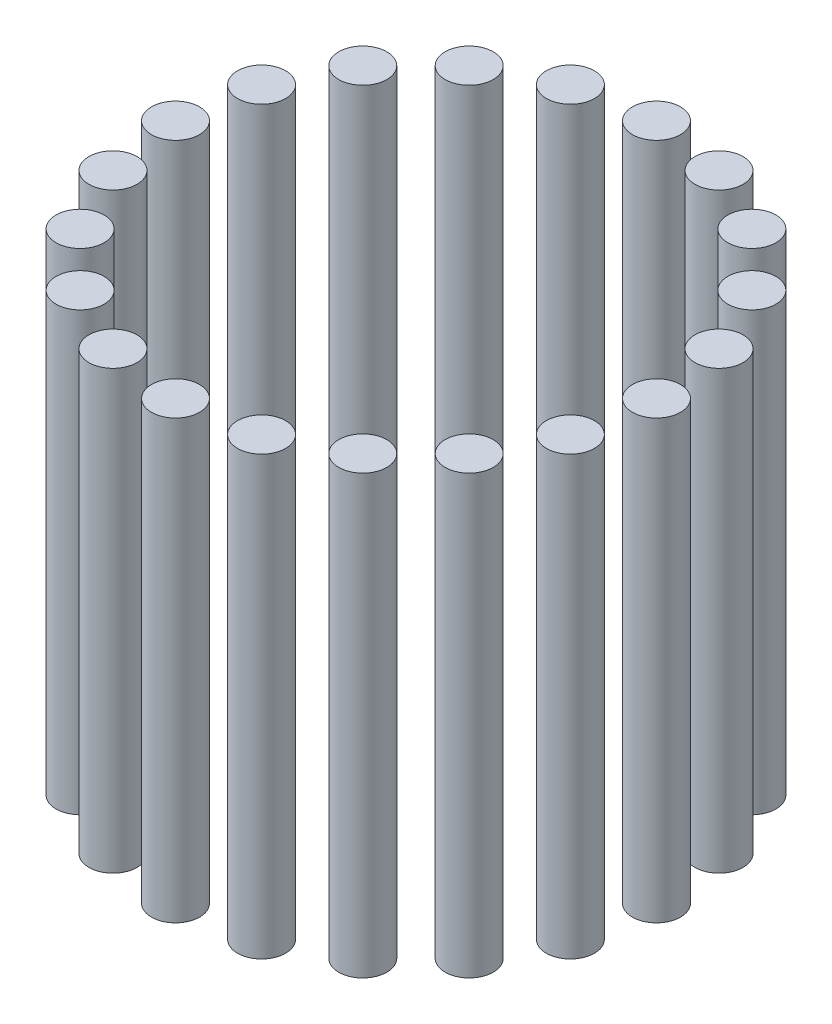
ISO-10303-21;
HEADER;
FILE_DESCRIPTION(('STEP AP214'),'2;1');
FILE_NAME('part.step','',(''),(''),'','','');
FILE_SCHEMA(('AUTOMOTIVE_DESIGN { 1 0 10303 214 1 1 1 1 }'));
ENDSEC;
DATA;
#1=APPLICATION_CONTEXT('core data for automotive mechanical design processes');
#2=APPLICATION_PROTOCOL_DEFINITION('international standard','automotive_design',2000,#1);
#3=PRODUCT_CONTEXT('',#1,'mechanical');
#4=PRODUCT('Part','Part','',(#3));
#5=PRODUCT_RELATED_PRODUCT_CATEGORY('part','',(#4));
#6=PRODUCT_DEFINITION_FORMATION('','',#4);
#7=PRODUCT_DEFINITION_CONTEXT('part definition',#1,'design');
#8=PRODUCT_DEFINITION('design','',#6,#7);
#9=PRODUCT_DEFINITION_SHAPE('','',#8);
#10=(LENGTH_UNIT() NAMED_UNIT(*) SI_UNIT(.MILLI.,.METRE.));
#11=(NAMED_UNIT(*) PLANE_ANGLE_UNIT() SI_UNIT($,.RADIAN.));
#12=(NAMED_UNIT(*) SI_UNIT($,.STERADIAN.) SOLID_ANGLE_UNIT());
#13=UNCERTAINTY_MEASURE_WITH_UNIT(LENGTH_MEASURE(1.E-05),#10,'distance_accuracy_value','');
#14=(GEOMETRIC_REPRESENTATION_CONTEXT(3) GLOBAL_UNCERTAINTY_ASSIGNED_CONTEXT((#13)) GLOBAL_UNIT_ASSIGNED_CONTEXT((#10,
#11,#12)) REPRESENTATION_CONTEXT('',''));
#15=CARTESIAN_POINT('',(0.,0.,0.));
#16=DIRECTION('',(0.,0.,1.));
#17=DIRECTION('',(1.,0.,0.));
#18=AXIS2_PLACEMENT_3D('',#15,#16,#17);
#19=CARTESIAN_POINT('',(52.3081083962337,100.,-16.9959346906214));
#20=DIRECTION('',(0.,-1.,0.));
#21=DIRECTION('',(0.,0.,-1.));
#22=AXIS2_PLACEMENT_3D('',#19,#20,#21);
#23=CYLINDRICAL_SURFACE('',#22,5.5);
#24=CARTESIAN_POINT('',(52.3081083962337,100.,-16.9959346906214));
#25=DIRECTION('',(0.,1.,0.));
#26=DIRECTION('',(0.,0.,1.));
#27=AXIS2_PLACEMENT_3D('',#24,#25,#26);
#28=CIRCLE('',#27,5.5);
#29=CARTESIAN_POINT('',(52.3081083962337,100.,-11.4959346906214));
#30=VERTEX_POINT('',#29);
#31=EDGE_CURVE('E48',#30,#30,#28,.T.);
#32=ORIENTED_EDGE('',*,*,#31,.F.);
#33=EDGE_LOOP('',(#32));
#34=FACE_BOUND('',#33,.T.);
#35=CARTESIAN_POINT('',(52.3081083962337,0.,-16.9959346906214));
#36=DIRECTION('',(0.,1.,0.));
#37=DIRECTION('',(0.,0.,1.));
#38=AXIS2_PLACEMENT_3D('',#35,#36,#37);
#39=CIRCLE('',#38,5.5);
#40=CARTESIAN_POINT('',(52.3081083962337,0.,-11.4959346906214));
#41=VERTEX_POINT('',#40);
#42=EDGE_CURVE('E11',#41,#41,#39,.T.);
#43=ORIENTED_EDGE('',*,*,#42,.T.);
#44=EDGE_LOOP('',(#43));
#45=FACE_BOUND('',#44,.T.);
#46=ADVANCED_FACE('F44',(#34,#45),#23,.T.);
#47=CARTESIAN_POINT('',(52.3081083962337,100.,-16.9959346906214));
#48=DIRECTION('',(0.,1.,0.));
#49=DIRECTION('',(0.,0.,1.));
#50=AXIS2_PLACEMENT_3D('',#47,#48,#49);
#51=PLANE('',#50);
#52=ORIENTED_EDGE('',*,*,#31,.T.);
#53=EDGE_LOOP('',(#52));
#54=FACE_BOUND('',#53,.T.);
#55=ADVANCED_FACE('F46',(#54),#51,.T.);
#56=CARTESIAN_POINT('',(52.3081083962337,0.,-16.9959346906214));
#57=DIRECTION('',(0.,1.,0.));
#58=DIRECTION('',(0.,0.,1.));
#59=AXIS2_PLACEMENT_3D('',#56,#57,#58);
#60=PLANE('',#59);
#61=ORIENTED_EDGE('',*,*,#42,.F.);
#62=EDGE_LOOP('',(#61));
#63=FACE_BOUND('',#62,.T.);
#64=ADVANCED_FACE('F63',(#63),#60,.F.);
#65=CLOSED_SHELL('',(#46,#55,#64));
#66=MANIFOLD_SOLID_BREP('B2',#65);
#67=CARTESIAN_POINT('',(44.4959346906225,100.,-32.3281888760854));
#68=DIRECTION('',(0.,-1.,0.));
#69=DIRECTION('',(0.,0.,-1.));
#70=AXIS2_PLACEMENT_3D('',#67,#68,#69);
#71=CYLINDRICAL_SURFACE('',#70,5.5);
#72=CARTESIAN_POINT('',(44.4959346906225,100.,-32.3281888760854));
#73=DIRECTION('',(0.,1.,0.));
#74=DIRECTION('',(0.,0.,1.));
#75=AXIS2_PLACEMENT_3D('',#72,#73,#74);
#76=CIRCLE('',#75,5.5);
#77=CARTESIAN_POINT('',(44.4959346906225,100.,-26.8281888760854));
#78=VERTEX_POINT('',#77);
#79=EDGE_CURVE('E103',#78,#78,#76,.T.);
#80=ORIENTED_EDGE('',*,*,#79,.F.);
#81=EDGE_LOOP('',(#80));
#82=FACE_BOUND('',#81,.T.);
#83=CARTESIAN_POINT('',(44.4959346906225,0.,-32.3281888760854));
#84=DIRECTION('',(0.,1.,0.));
#85=DIRECTION('',(0.,0.,1.));
#86=AXIS2_PLACEMENT_3D('',#83,#84,#85);
#87=CIRCLE('',#86,5.5);
#88=CARTESIAN_POINT('',(44.4959346906225,0.,-26.8281888760854));
#89=VERTEX_POINT('',#88);
#90=EDGE_CURVE('E43',#89,#89,#87,.T.);
#91=ORIENTED_EDGE('',*,*,#90,.T.);
#92=EDGE_LOOP('',(#91));
#93=FACE_BOUND('',#92,.T.);
#94=ADVANCED_FACE('F99',(#82,#93),#71,.T.);
#95=CARTESIAN_POINT('',(44.4959346906225,100.,-32.3281888760854));
#96=DIRECTION('',(0.,1.,0.));
#97=DIRECTION('',(0.,0.,1.));
#98=AXIS2_PLACEMENT_3D('',#95,#96,#97);
#99=PLANE('',#98);
#100=ORIENTED_EDGE('',*,*,#79,.T.);
#101=EDGE_LOOP('',(#100));
#102=FACE_BOUND('',#101,.T.);
#103=ADVANCED_FACE('F101',(#102),#99,.T.);
#104=CARTESIAN_POINT('',(44.4959346906225,0.,-32.3281888760854));
#105=DIRECTION('',(0.,1.,0.));
#106=DIRECTION('',(0.,0.,1.));
#107=AXIS2_PLACEMENT_3D('',#104,#105,#106);
#108=PLANE('',#107);
#109=ORIENTED_EDGE('',*,*,#90,.F.);
#110=EDGE_LOOP('',(#109));
#111=FACE_BOUND('',#110,.T.);
#112=ADVANCED_FACE('F118',(#111),#108,.F.);
#113=CLOSED_SHELL('',(#94,#103,#112));
#114=MANIFOLD_SOLID_BREP('B6',#113);
#115=CARTESIAN_POINT('',(32.3281888760866,100.,-44.4959346906217));
#116=DIRECTION('',(0.,-1.,0.));
#117=DIRECTION('',(0.,0.,-1.));
#118=AXIS2_PLACEMENT_3D('',#115,#116,#117);
#119=CYLINDRICAL_SURFACE('',#118,5.5);
#120=CARTESIAN_POINT('',(32.3281888760866,100.,-44.4959346906217));
#121=DIRECTION('',(0.,1.,0.));
#122=DIRECTION('',(0.,0.,1.));
#123=AXIS2_PLACEMENT_3D('',#120,#121,#122);
#124=CIRCLE('',#123,5.5);
#125=CARTESIAN_POINT('',(32.3281888760866,100.,-38.9959346906217));
#126=VERTEX_POINT('',#125);
#127=EDGE_CURVE('E158',#126,#126,#124,.T.);
#128=ORIENTED_EDGE('',*,*,#127,.F.);
#129=EDGE_LOOP('',(#128));
#130=FACE_BOUND('',#129,.T.);
#131=CARTESIAN_POINT('',(32.3281888760866,0.,-44.4959346906217));
#132=DIRECTION('',(0.,1.,0.));
#133=DIRECTION('',(0.,0.,1.));
#134=AXIS2_PLACEMENT_3D('',#131,#132,#133);
#135=CIRCLE('',#134,5.5);
#136=CARTESIAN_POINT('',(32.3281888760866,0.,-38.9959346906217));
#137=VERTEX_POINT('',#136);
#138=EDGE_CURVE('E98',#137,#137,#135,.T.);
#139=ORIENTED_EDGE('',*,*,#138,.T.);
#140=EDGE_LOOP('',(#139));
#141=FACE_BOUND('',#140,.T.);
#142=ADVANCED_FACE('F154',(#130,#141),#119,.T.);
#143=CARTESIAN_POINT('',(32.3281888760866,100.,-44.4959346906217));
#144=DIRECTION('',(0.,1.,0.));
#145=DIRECTION('',(0.,0.,1.));
#146=AXIS2_PLACEMENT_3D('',#143,#144,#145);
#147=PLANE('',#146);
#148=ORIENTED_EDGE('',*,*,#127,.T.);
#149=EDGE_LOOP('',(#148));
#150=FACE_BOUND('',#149,.T.);
#151=ADVANCED_FACE('F156',(#150),#147,.T.);
#152=CARTESIAN_POINT('',(32.3281888760866,0.,-44.4959346906217));
#153=DIRECTION('',(0.,1.,0.));
#154=DIRECTION('',(0.,0.,1.));
#155=AXIS2_PLACEMENT_3D('',#152,#153,#154);
#156=PLANE('',#155);
#157=ORIENTED_EDGE('',*,*,#138,.F.);
#158=EDGE_LOOP('',(#157));
#159=FACE_BOUND('',#158,.T.);
#160=ADVANCED_FACE('F173',(#159),#156,.F.);
#161=CLOSED_SHELL('',(#142,#151,#160));
#162=MANIFOLD_SOLID_BREP('B38',#161);
#163=CARTESIAN_POINT('',(16.9959346906227,100.,-52.3081083962333));
#164=DIRECTION('',(0.,-1.,0.));
#165=DIRECTION('',(0.,0.,-1.));
#166=AXIS2_PLACEMENT_3D('',#163,#164,#165);
#167=CYLINDRICAL_SURFACE('',#166,5.5);
#168=CARTESIAN_POINT('',(16.9959346906227,100.,-52.3081083962333));
#169=DIRECTION('',(0.,1.,0.));
#170=DIRECTION('',(0.,0.,1.));
#171=AXIS2_PLACEMENT_3D('',#168,#169,#170);
#172=CIRCLE('',#171,5.5);
#173=CARTESIAN_POINT('',(16.9959346906227,100.,-46.8081083962333));
#174=VERTEX_POINT('',#173);
#175=EDGE_CURVE('E213',#174,#174,#172,.T.);
#176=ORIENTED_EDGE('',*,*,#175,.F.);
#177=EDGE_LOOP('',(#176));
#178=FACE_BOUND('',#177,.T.);
#179=CARTESIAN_POINT('',(16.9959346906227,0.,-52.3081083962333));
#180=DIRECTION('',(0.,1.,0.));
#181=DIRECTION('',(0.,0.,1.));
#182=AXIS2_PLACEMENT_3D('',#179,#180,#181);
#183=CIRCLE('',#182,5.5);
#184=CARTESIAN_POINT('',(16.9959346906227,0.,-46.8081083962333));
#185=VERTEX_POINT('',#184);
#186=EDGE_CURVE('E153',#185,#185,#183,.T.);
#187=ORIENTED_EDGE('',*,*,#186,.T.);
#188=EDGE_LOOP('',(#187));
#189=FACE_BOUND('',#188,.T.);
#190=ADVANCED_FACE('F209',(#178,#189),#167,.T.);
#191=CARTESIAN_POINT('',(16.9959346906227,100.,-52.3081083962333));
#192=DIRECTION('',(0.,1.,0.));
#193=DIRECTION('',(0.,0.,1.));
#194=AXIS2_PLACEMENT_3D('',#191,#192,#193);
#195=PLANE('',#194);
#196=ORIENTED_EDGE('',*,*,#175,.T.);
#197=EDGE_LOOP('',(#196));
#198=FACE_BOUND('',#197,.T.);
#199=ADVANCED_FACE('F211',(#198),#195,.T.);
#200=CARTESIAN_POINT('',(16.9959346906227,0.,-52.3081083962333));
#201=DIRECTION('',(0.,1.,0.));
#202=DIRECTION('',(0.,0.,1.));
#203=AXIS2_PLACEMENT_3D('',#200,#201,#202);
#204=PLANE('',#203);
#205=ORIENTED_EDGE('',*,*,#186,.F.);
#206=EDGE_LOOP('',(#205));
#207=FACE_BOUND('',#206,.T.);
#208=ADVANCED_FACE('F228',(#207),#204,.F.);
#209=CLOSED_SHELL('',(#190,#199,#208));
#210=MANIFOLD_SOLID_BREP('B93',#209);
#211=CARTESIAN_POINT('',(5.76094420909117E-13,100.,-55.));
#212=DIRECTION('',(0.,-1.,0.));
#213=DIRECTION('',(0.,0.,-1.));
#214=AXIS2_PLACEMENT_3D('',#211,#212,#213);
#215=CYLINDRICAL_SURFACE('',#214,5.49999999999999);
#216=CARTESIAN_POINT('',(5.76094420909117E-13,100.,-55.));
#217=DIRECTION('',(0.,1.,0.));
#218=DIRECTION('',(0.,0.,1.));
#219=AXIS2_PLACEMENT_3D('',#216,#217,#218);
#220=CIRCLE('',#219,5.49999999999999);
#221=CARTESIAN_POINT('',(5.76094420909117E-13,100.,-49.5));
#222=VERTEX_POINT('',#221);
#223=EDGE_CURVE('E268',#222,#222,#220,.T.);
#224=ORIENTED_EDGE('',*,*,#223,.F.);
#225=EDGE_LOOP('',(#224));
#226=FACE_BOUND('',#225,.T.);
#227=CARTESIAN_POINT('',(5.76094420909117E-13,0.,-55.));
#228=DIRECTION('',(0.,1.,0.));
#229=DIRECTION('',(0.,0.,1.));
#230=AXIS2_PLACEMENT_3D('',#227,#228,#229);
#231=CIRCLE('',#230,5.49999999999999);
#232=CARTESIAN_POINT('',(5.76094420909117E-13,0.,-49.5));
#233=VERTEX_POINT('',#232);
#234=EDGE_CURVE('E208',#233,#233,#231,.T.);
#235=ORIENTED_EDGE('',*,*,#234,.T.);
#236=EDGE_LOOP('',(#235));
#237=FACE_BOUND('',#236,.T.);
#238=ADVANCED_FACE('F264',(#226,#237),#215,.T.);
#239=CARTESIAN_POINT('',(5.76094420909117E-13,100.,-55.));
#240=DIRECTION('',(0.,1.,0.));
#241=DIRECTION('',(0.,0.,1.));
#242=AXIS2_PLACEMENT_3D('',#239,#240,#241);
#243=PLANE('',#242);
#244=ORIENTED_EDGE('',*,*,#223,.T.);
#245=EDGE_LOOP('',(#244));
#246=FACE_BOUND('',#245,.T.);
#247=ADVANCED_FACE('F266',(#246),#243,.T.);
#248=CARTESIAN_POINT('',(5.76094420909117E-13,0.,-55.));
#249=DIRECTION('',(0.,1.,0.));
#250=DIRECTION('',(0.,0.,1.));
#251=AXIS2_PLACEMENT_3D('',#248,#249,#250);
#252=PLANE('',#251);
#253=ORIENTED_EDGE('',*,*,#234,.F.);
#254=EDGE_LOOP('',(#253));
#255=FACE_BOUND('',#254,.T.);
#256=ADVANCED_FACE('F283',(#255),#252,.F.);
#257=CLOSED_SHELL('',(#238,#247,#256));
#258=MANIFOLD_SOLID_BREP('B148',#257);
#259=CARTESIAN_POINT('',(-16.9959346906216,100.,-52.3081083962336));
#260=DIRECTION('',(0.,-1.,0.));
#261=DIRECTION('',(0.,0.,-1.));
#262=AXIS2_PLACEMENT_3D('',#259,#260,#261);
#263=CYLINDRICAL_SURFACE('',#262,5.5);
#264=CARTESIAN_POINT('',(-16.9959346906216,100.,-52.3081083962336));
#265=DIRECTION('',(0.,1.,0.));
#266=DIRECTION('',(0.,0.,1.));
#267=AXIS2_PLACEMENT_3D('',#264,#265,#266);
#268=CIRCLE('',#267,5.5);
#269=CARTESIAN_POINT('',(-16.9959346906216,100.,-46.8081083962336));
#270=VERTEX_POINT('',#269);
#271=EDGE_CURVE('E323',#270,#270,#268,.T.);
#272=ORIENTED_EDGE('',*,*,#271,.F.);
#273=EDGE_LOOP('',(#272));
#274=FACE_BOUND('',#273,.T.);
#275=CARTESIAN_POINT('',(-16.9959346906216,0.,-52.3081083962336));
#276=DIRECTION('',(0.,1.,0.));
#277=DIRECTION('',(0.,0.,1.));
#278=AXIS2_PLACEMENT_3D('',#275,#276,#277);
#279=CIRCLE('',#278,5.5);
#280=CARTESIAN_POINT('',(-16.9959346906216,0.,-46.8081083962336));
#281=VERTEX_POINT('',#280);
#282=EDGE_CURVE('E263',#281,#281,#279,.T.);
#283=ORIENTED_EDGE('',*,*,#282,.T.);
#284=EDGE_LOOP('',(#283));
#285=FACE_BOUND('',#284,.T.);
#286=ADVANCED_FACE('F319',(#274,#285),#263,.T.);
#287=CARTESIAN_POINT('',(-16.9959346906216,100.,-52.3081083962336));
#288=DIRECTION('',(0.,1.,0.));
#289=DIRECTION('',(0.,0.,1.));
#290=AXIS2_PLACEMENT_3D('',#287,#288,#289);
#291=PLANE('',#290);
#292=ORIENTED_EDGE('',*,*,#271,.T.);
#293=EDGE_LOOP('',(#292));
#294=FACE_BOUND('',#293,.T.);
#295=ADVANCED_FACE('F321',(#294),#291,.T.);
#296=CARTESIAN_POINT('',(-16.9959346906216,0.,-52.3081083962336));
#297=DIRECTION('',(0.,1.,0.));
#298=DIRECTION('',(0.,0.,1.));
#299=AXIS2_PLACEMENT_3D('',#296,#297,#298);
#300=PLANE('',#299);
#301=ORIENTED_EDGE('',*,*,#282,.F.);
#302=EDGE_LOOP('',(#301));
#303=FACE_BOUND('',#302,.T.);
#304=ADVANCED_FACE('F338',(#303),#300,.F.);
#305=CLOSED_SHELL('',(#286,#295,#304));
#306=MANIFOLD_SOLID_BREP('B203',#305);
#307=CARTESIAN_POINT('',(-32.3281888760856,100.,-44.4959346906224));
#308=DIRECTION('',(0.,-1.,0.));
#309=DIRECTION('',(0.,0.,-1.));
#310=AXIS2_PLACEMENT_3D('',#307,#308,#309);
#311=CYLINDRICAL_SURFACE('',#310,5.49999999999999);
#312=CARTESIAN_POINT('',(-32.3281888760856,100.,-44.4959346906224));
#313=DIRECTION('',(0.,1.,0.));
#314=DIRECTION('',(0.,0.,1.));
#315=AXIS2_PLACEMENT_3D('',#312,#313,#314);
#316=CIRCLE('',#315,5.49999999999999);
#317=CARTESIAN_POINT('',(-32.3281888760856,100.,-38.9959346906224));
#318=VERTEX_POINT('',#317);
#319=EDGE_CURVE('E378',#318,#318,#316,.T.);
#320=ORIENTED_EDGE('',*,*,#319,.F.);
#321=EDGE_LOOP('',(#320));
#322=FACE_BOUND('',#321,.T.);
#323=CARTESIAN_POINT('',(-32.3281888760856,0.,-44.4959346906224));
#324=DIRECTION('',(0.,1.,0.));
#325=DIRECTION('',(0.,0.,1.));
#326=AXIS2_PLACEMENT_3D('',#323,#324,#325);
#327=CIRCLE('',#326,5.49999999999999);
#328=CARTESIAN_POINT('',(-32.3281888760856,0.,-38.9959346906224));
#329=VERTEX_POINT('',#328);
#330=EDGE_CURVE('E318',#329,#329,#327,.T.);
#331=ORIENTED_EDGE('',*,*,#330,.T.);
#332=EDGE_LOOP('',(#331));
#333=FACE_BOUND('',#332,.T.);
#334=ADVANCED_FACE('F374',(#322,#333),#311,.T.);
#335=CARTESIAN_POINT('',(-32.3281888760856,100.,-44.4959346906224));
#336=DIRECTION('',(0.,1.,0.));
#337=DIRECTION('',(0.,0.,1.));
#338=AXIS2_PLACEMENT_3D('',#335,#336,#337);
#339=PLANE('',#338);
#340=ORIENTED_EDGE('',*,*,#319,.T.);
#341=EDGE_LOOP('',(#340));
#342=FACE_BOUND('',#341,.T.);
#343=ADVANCED_FACE('F376',(#342),#339,.T.);
#344=CARTESIAN_POINT('',(-32.3281888760856,0.,-44.4959346906224));
#345=DIRECTION('',(0.,1.,0.));
#346=DIRECTION('',(0.,0.,1.));
#347=AXIS2_PLACEMENT_3D('',#344,#345,#346);
#348=PLANE('',#347);
#349=ORIENTED_EDGE('',*,*,#330,.F.);
#350=EDGE_LOOP('',(#349));
#351=FACE_BOUND('',#350,.T.);
#352=ADVANCED_FACE('F393',(#351),#348,.F.);
#353=CLOSED_SHELL('',(#334,#343,#352));
#354=MANIFOLD_SOLID_BREP('B258',#353);
#355=CARTESIAN_POINT('',(-44.4959346906218,100.,-32.3281888760864));
#356=DIRECTION('',(0.,-1.,0.));
#357=DIRECTION('',(0.,0.,-1.));
#358=AXIS2_PLACEMENT_3D('',#355,#356,#357);
#359=CYLINDRICAL_SURFACE('',#358,5.49999999999999);
#360=CARTESIAN_POINT('',(-44.4959346906218,100.,-32.3281888760864));
#361=DIRECTION('',(0.,1.,0.));
#362=DIRECTION('',(0.,0.,1.));
#363=AXIS2_PLACEMENT_3D('',#360,#361,#362);
#364=CIRCLE('',#363,5.49999999999999);
#365=CARTESIAN_POINT('',(-44.4959346906218,100.,-26.8281888760864));
#366=VERTEX_POINT('',#365);
#367=EDGE_CURVE('E433',#366,#366,#364,.T.);
#368=ORIENTED_EDGE('',*,*,#367,.F.);
#369=EDGE_LOOP('',(#368));
#370=FACE_BOUND('',#369,.T.);
#371=CARTESIAN_POINT('',(-44.4959346906218,0.,-32.3281888760864));
#372=DIRECTION('',(0.,1.,0.));
#373=DIRECTION('',(0.,0.,1.));
#374=AXIS2_PLACEMENT_3D('',#371,#372,#373);
#375=CIRCLE('',#374,5.49999999999999);
#376=CARTESIAN_POINT('',(-44.4959346906218,0.,-26.8281888760864));
#377=VERTEX_POINT('',#376);
#378=EDGE_CURVE('E373',#377,#377,#375,.T.);
#379=ORIENTED_EDGE('',*,*,#378,.T.);
#380=EDGE_LOOP('',(#379));
#381=FACE_BOUND('',#380,.T.);
#382=ADVANCED_FACE('F429',(#370,#381),#359,.T.);
#383=CARTESIAN_POINT('',(-44.4959346906218,100.,-32.3281888760864));
#384=DIRECTION('',(0.,1.,0.));
#385=DIRECTION('',(0.,0.,1.));
#386=AXIS2_PLACEMENT_3D('',#383,#384,#385);
#387=PLANE('',#386);
#388=ORIENTED_EDGE('',*,*,#367,.T.);
#389=EDGE_LOOP('',(#388));
#390=FACE_BOUND('',#389,.T.);
#391=ADVANCED_FACE('F431',(#390),#387,.T.);
#392=CARTESIAN_POINT('',(-44.4959346906218,0.,-32.3281888760864));
#393=DIRECTION('',(0.,1.,0.));
#394=DIRECTION('',(0.,0.,1.));
#395=AXIS2_PLACEMENT_3D('',#392,#393,#394);
#396=PLANE('',#395);
#397=ORIENTED_EDGE('',*,*,#378,.F.);
#398=EDGE_LOOP('',(#397));
#399=FACE_BOUND('',#398,.T.);
#400=ADVANCED_FACE('F448',(#399),#396,.F.);
#401=CLOSED_SHELL('',(#382,#391,#400));
#402=MANIFOLD_SOLID_BREP('B313',#401);
#403=CARTESIAN_POINT('',(-52.3081083962333,100.,-16.9959346906225));
#404=DIRECTION('',(0.,-1.,0.));
#405=DIRECTION('',(0.,0.,-1.));
#406=AXIS2_PLACEMENT_3D('',#403,#404,#405);
#407=CYLINDRICAL_SURFACE('',#406,5.49999999999999);
#408=CARTESIAN_POINT('',(-52.3081083962333,100.,-16.9959346906225));
#409=DIRECTION('',(0.,1.,0.));
#410=DIRECTION('',(0.,0.,1.));
#411=AXIS2_PLACEMENT_3D('',#408,#409,#410);
#412=CIRCLE('',#411,5.49999999999999);
#413=CARTESIAN_POINT('',(-52.3081083962333,100.,-11.4959346906225));
#414=VERTEX_POINT('',#413);
#415=EDGE_CURVE('E488',#414,#414,#412,.T.);
#416=ORIENTED_EDGE('',*,*,#415,.F.);
#417=EDGE_LOOP('',(#416));
#418=FACE_BOUND('',#417,.T.);
#419=CARTESIAN_POINT('',(-52.3081083962333,0.,-16.9959346906225));
#420=DIRECTION('',(0.,1.,0.));
#421=DIRECTION('',(0.,0.,1.));
#422=AXIS2_PLACEMENT_3D('',#419,#420,#421);
#423=CIRCLE('',#422,5.49999999999999);
#424=CARTESIAN_POINT('',(-52.3081083962333,0.,-11.4959346906225));
#425=VERTEX_POINT('',#424);
#426=EDGE_CURVE('E428',#425,#425,#423,.T.);
#427=ORIENTED_EDGE('',*,*,#426,.T.);
#428=EDGE_LOOP('',(#427));
#429=FACE_BOUND('',#428,.T.);
#430=ADVANCED_FACE('F484',(#418,#429),#407,.T.);
#431=CARTESIAN_POINT('',(-52.3081083962333,100.,-16.9959346906225));
#432=DIRECTION('',(0.,1.,0.));
#433=DIRECTION('',(0.,0.,1.));
#434=AXIS2_PLACEMENT_3D('',#431,#432,#433);
#435=PLANE('',#434);
#436=ORIENTED_EDGE('',*,*,#415,.T.);
#437=EDGE_LOOP('',(#436));
#438=FACE_BOUND('',#437,.T.);
#439=ADVANCED_FACE('F486',(#438),#435,.T.);
#440=CARTESIAN_POINT('',(-52.3081083962333,0.,-16.9959346906225));
#441=DIRECTION('',(0.,1.,0.));
#442=DIRECTION('',(0.,0.,1.));
#443=AXIS2_PLACEMENT_3D('',#440,#441,#442);
#444=PLANE('',#443);
#445=ORIENTED_EDGE('',*,*,#426,.F.);
#446=EDGE_LOOP('',(#445));
#447=FACE_BOUND('',#446,.T.);
#448=ADVANCED_FACE('F503',(#447),#444,.F.);
#449=CLOSED_SHELL('',(#430,#439,#448));
#450=MANIFOLD_SOLID_BREP('B368',#449);
#451=CARTESIAN_POINT('',(-55.,100.,-3.84062947272745E-13));
#452=DIRECTION('',(0.,-1.,0.));
#453=DIRECTION('',(0.,0.,-1.));
#454=AXIS2_PLACEMENT_3D('',#451,#452,#453);
#455=CYLINDRICAL_SURFACE('',#454,5.5);
#456=CARTESIAN_POINT('',(-55.,100.,-3.84062947272745E-13));
#457=DIRECTION('',(0.,1.,0.));
#458=DIRECTION('',(0.,0.,1.));
#459=AXIS2_PLACEMENT_3D('',#456,#457,#458);
#460=CIRCLE('',#459,5.5);
#461=CARTESIAN_POINT('',(-55.,100.,5.49999999999961));
#462=VERTEX_POINT('',#461);
#463=EDGE_CURVE('E543',#462,#462,#460,.T.);
#464=ORIENTED_EDGE('',*,*,#463,.F.);
#465=EDGE_LOOP('',(#464));
#466=FACE_BOUND('',#465,.T.);
#467=CARTESIAN_POINT('',(-55.,0.,-3.84062947272745E-13));
#468=DIRECTION('',(0.,1.,0.));
#469=DIRECTION('',(0.,0.,1.));
#470=AXIS2_PLACEMENT_3D('',#467,#468,#469);
#471=CIRCLE('',#470,5.5);
#472=CARTESIAN_POINT('',(-55.,0.,5.49999999999961));
#473=VERTEX_POINT('',#472);
#474=EDGE_CURVE('E483',#473,#473,#471,.T.);
#475=ORIENTED_EDGE('',*,*,#474,.T.);
#476=EDGE_LOOP('',(#475));
#477=FACE_BOUND('',#476,.T.);
#478=ADVANCED_FACE('F539',(#466,#477),#455,.T.);
#479=CARTESIAN_POINT('',(-55.,100.,-3.84062947272745E-13));
#480=DIRECTION('',(0.,1.,0.));
#481=DIRECTION('',(0.,0.,1.));
#482=AXIS2_PLACEMENT_3D('',#479,#480,#481);
#483=PLANE('',#482);
#484=ORIENTED_EDGE('',*,*,#463,.T.);
#485=EDGE_LOOP('',(#484));
#486=FACE_BOUND('',#485,.T.);
#487=ADVANCED_FACE('F541',(#486),#483,.T.);
#488=CARTESIAN_POINT('',(-55.,0.,-3.84062947272745E-13));
#489=DIRECTION('',(0.,1.,0.));
#490=DIRECTION('',(0.,0.,1.));
#491=AXIS2_PLACEMENT_3D('',#488,#489,#490);
#492=PLANE('',#491);
#493=ORIENTED_EDGE('',*,*,#474,.F.);
#494=EDGE_LOOP('',(#493));
#495=FACE_BOUND('',#494,.T.);
#496=ADVANCED_FACE('F558',(#495),#492,.F.);
#497=CLOSED_SHELL('',(#478,#487,#496));
#498=MANIFOLD_SOLID_BREP('B423',#497);
#499=CARTESIAN_POINT('',(-52.3081083962335,100.,16.9959346906218));
#500=DIRECTION('',(0.,-1.,0.));
#501=DIRECTION('',(0.,0.,-1.));
#502=AXIS2_PLACEMENT_3D('',#499,#500,#501);
#503=CYLINDRICAL_SURFACE('',#502,5.5);
#504=CARTESIAN_POINT('',(-52.3081083962335,100.,16.9959346906218));
#505=DIRECTION('',(0.,1.,0.));
#506=DIRECTION('',(0.,0.,1.));
#507=AXIS2_PLACEMENT_3D('',#504,#505,#506);
#508=CIRCLE('',#507,5.5);
#509=CARTESIAN_POINT('',(-52.3081083962335,100.,22.4959346906218));
#510=VERTEX_POINT('',#509);
#511=EDGE_CURVE('E598',#510,#510,#508,.T.);
#512=ORIENTED_EDGE('',*,*,#511,.F.);
#513=EDGE_LOOP('',(#512));
#514=FACE_BOUND('',#513,.T.);
#515=CARTESIAN_POINT('',(-52.3081083962335,0.,16.9959346906218));
#516=DIRECTION('',(0.,1.,0.));
#517=DIRECTION('',(0.,0.,1.));
#518=AXIS2_PLACEMENT_3D('',#515,#516,#517);
#519=CIRCLE('',#518,5.5);
#520=CARTESIAN_POINT('',(-52.3081083962335,0.,22.4959346906218));
#521=VERTEX_POINT('',#520);
#522=EDGE_CURVE('E538',#521,#521,#519,.T.);
#523=ORIENTED_EDGE('',*,*,#522,.T.);
#524=EDGE_LOOP('',(#523));
#525=FACE_BOUND('',#524,.T.);
#526=ADVANCED_FACE('F594',(#514,#525),#503,.T.);
#527=CARTESIAN_POINT('',(-52.3081083962335,100.,16.9959346906218));
#528=DIRECTION('',(0.,1.,0.));
#529=DIRECTION('',(0.,0.,1.));
#530=AXIS2_PLACEMENT_3D('',#527,#528,#529);
#531=PLANE('',#530);
#532=ORIENTED_EDGE('',*,*,#511,.T.);
#533=EDGE_LOOP('',(#532));
#534=FACE_BOUND('',#533,.T.);
#535=ADVANCED_FACE('F596',(#534),#531,.T.);
#536=CARTESIAN_POINT('',(-52.3081083962335,0.,16.9959346906218));
#537=DIRECTION('',(0.,1.,0.));
#538=DIRECTION('',(0.,0.,1.));
#539=AXIS2_PLACEMENT_3D('',#536,#537,#538);
#540=PLANE('',#539);
#541=ORIENTED_EDGE('',*,*,#522,.F.);
#542=EDGE_LOOP('',(#541));
#543=FACE_BOUND('',#542,.T.);
#544=ADVANCED_FACE('F613',(#543),#540,.F.);
#545=CLOSED_SHELL('',(#526,#535,#544));
#546=MANIFOLD_SOLID_BREP('B478',#545);
#547=CARTESIAN_POINT('',(-44.4959346906223,100.,32.3281888760858));
#548=DIRECTION('',(0.,-1.,0.));
#549=DIRECTION('',(0.,0.,-1.));
#550=AXIS2_PLACEMENT_3D('',#547,#548,#549);
#551=CYLINDRICAL_SURFACE('',#550,5.5);
#552=CARTESIAN_POINT('',(-44.4959346906223,100.,32.3281888760858));
#553=DIRECTION('',(0.,1.,0.));
#554=DIRECTION('',(0.,0.,1.));
#555=AXIS2_PLACEMENT_3D('',#552,#553,#554);
#556=CIRCLE('',#555,5.5);
#557=CARTESIAN_POINT('',(-44.4959346906223,100.,37.8281888760858));
#558=VERTEX_POINT('',#557);
#559=EDGE_CURVE('E653',#558,#558,#556,.T.);
#560=ORIENTED_EDGE('',*,*,#559,.F.);
#561=EDGE_LOOP('',(#560));
#562=FACE_BOUND('',#561,.T.);
#563=CARTESIAN_POINT('',(-44.4959346906223,0.,32.3281888760858));
#564=DIRECTION('',(0.,1.,0.));
#565=DIRECTION('',(0.,0.,1.));
#566=AXIS2_PLACEMENT_3D('',#563,#564,#565);
#567=CIRCLE('',#566,5.5);
#568=CARTESIAN_POINT('',(-44.4959346906223,0.,37.8281888760858));
#569=VERTEX_POINT('',#568);
#570=EDGE_CURVE('E593',#569,#569,#567,.T.);
#571=ORIENTED_EDGE('',*,*,#570,.T.);
#572=EDGE_LOOP('',(#571));
#573=FACE_BOUND('',#572,.T.);
#574=ADVANCED_FACE('F649',(#562,#573),#551,.T.);
#575=CARTESIAN_POINT('',(-44.4959346906223,100.,32.3281888760858));
#576=DIRECTION('',(0.,1.,0.));
#577=DIRECTION('',(0.,0.,1.));
#578=AXIS2_PLACEMENT_3D('',#575,#576,#577);
#579=PLANE('',#578);
#580=ORIENTED_EDGE('',*,*,#559,.T.);
#581=EDGE_LOOP('',(#580));
#582=FACE_BOUND('',#581,.T.);
#583=ADVANCED_FACE('F651',(#582),#579,.T.);
#584=CARTESIAN_POINT('',(-44.4959346906223,0.,32.3281888760858));
#585=DIRECTION('',(0.,1.,0.));
#586=DIRECTION('',(0.,0.,1.));
#587=AXIS2_PLACEMENT_3D('',#584,#585,#586);
#588=PLANE('',#587);
#589=ORIENTED_EDGE('',*,*,#570,.F.);
#590=EDGE_LOOP('',(#589));
#591=FACE_BOUND('',#590,.T.);
#592=ADVANCED_FACE('F668',(#591),#588,.F.);
#593=CLOSED_SHELL('',(#574,#583,#592));
#594=MANIFOLD_SOLID_BREP('B533',#593);
#595=CARTESIAN_POINT('',(-32.3281888760862,100.,44.495934690622));
#596=DIRECTION('',(0.,-1.,0.));
#597=DIRECTION('',(0.,0.,-1.));
#598=AXIS2_PLACEMENT_3D('',#595,#596,#597);
#599=CYLINDRICAL_SURFACE('',#598,5.49999999999999);
#600=CARTESIAN_POINT('',(-32.3281888760862,100.,44.495934690622));
#601=DIRECTION('',(0.,1.,0.));
#602=DIRECTION('',(0.,0.,1.));
#603=AXIS2_PLACEMENT_3D('',#600,#601,#602);
#604=CIRCLE('',#603,5.49999999999999);
#605=CARTESIAN_POINT('',(-32.3281888760862,100.,49.9959346906219));
#606=VERTEX_POINT('',#605);
#607=EDGE_CURVE('E708',#606,#606,#604,.T.);
#608=ORIENTED_EDGE('',*,*,#607,.F.);
#609=EDGE_LOOP('',(#608));
#610=FACE_BOUND('',#609,.T.);
#611=CARTESIAN_POINT('',(-32.3281888760862,0.,44.495934690622));
#612=DIRECTION('',(0.,1.,0.));
#613=DIRECTION('',(0.,0.,1.));
#614=AXIS2_PLACEMENT_3D('',#611,#612,#613);
#615=CIRCLE('',#614,5.49999999999999);
#616=CARTESIAN_POINT('',(-32.3281888760862,0.,49.9959346906219));
#617=VERTEX_POINT('',#616);
#618=EDGE_CURVE('E648',#617,#617,#615,.T.);
#619=ORIENTED_EDGE('',*,*,#618,.T.);
#620=EDGE_LOOP('',(#619));
#621=FACE_BOUND('',#620,.T.);
#622=ADVANCED_FACE('F704',(#610,#621),#599,.T.);
#623=CARTESIAN_POINT('',(-32.3281888760862,100.,44.495934690622));
#624=DIRECTION('',(0.,1.,0.));
#625=DIRECTION('',(0.,0.,1.));
#626=AXIS2_PLACEMENT_3D('',#623,#624,#625);
#627=PLANE('',#626);
#628=ORIENTED_EDGE('',*,*,#607,.T.);
#629=EDGE_LOOP('',(#628));
#630=FACE_BOUND('',#629,.T.);
#631=ADVANCED_FACE('F706',(#630),#627,.T.);
#632=CARTESIAN_POINT('',(-32.3281888760862,0.,44.495934690622));
#633=DIRECTION('',(0.,1.,0.));
#634=DIRECTION('',(0.,0.,1.));
#635=AXIS2_PLACEMENT_3D('',#632,#633,#634);
#636=PLANE('',#635);
#637=ORIENTED_EDGE('',*,*,#618,.F.);
#638=EDGE_LOOP('',(#637));
#639=FACE_BOUND('',#638,.T.);
#640=ADVANCED_FACE('F723',(#639),#636,.F.);
#641=CLOSED_SHELL('',(#622,#631,#640));
#642=MANIFOLD_SOLID_BREP('B588',#641);
#643=CARTESIAN_POINT('',(-16.9959346906223,100.,52.3081083962334));
#644=DIRECTION('',(0.,-1.,0.));
#645=DIRECTION('',(0.,0.,-1.));
#646=AXIS2_PLACEMENT_3D('',#643,#644,#645);
#647=CYLINDRICAL_SURFACE('',#646,5.49999999999999);
#648=CARTESIAN_POINT('',(-16.9959346906223,100.,52.3081083962334));
#649=DIRECTION('',(0.,1.,0.));
#650=DIRECTION('',(0.,0.,1.));
#651=AXIS2_PLACEMENT_3D('',#648,#649,#650);
#652=CIRCLE('',#651,5.49999999999999);
#653=CARTESIAN_POINT('',(-16.9959346906223,100.,57.8081083962334));
#654=VERTEX_POINT('',#653);
#655=EDGE_CURVE('E763',#654,#654,#652,.T.);
#656=ORIENTED_EDGE('',*,*,#655,.F.);
#657=EDGE_LOOP('',(#656));
#658=FACE_BOUND('',#657,.T.);
#659=CARTESIAN_POINT('',(-16.9959346906223,0.,52.3081083962334));
#660=DIRECTION('',(0.,1.,0.));
#661=DIRECTION('',(0.,0.,1.));
#662=AXIS2_PLACEMENT_3D('',#659,#660,#661);
#663=CIRCLE('',#662,5.49999999999999);
#664=CARTESIAN_POINT('',(-16.9959346906223,0.,57.8081083962334));
#665=VERTEX_POINT('',#664);
#666=EDGE_CURVE('E703',#665,#665,#663,.T.);
#667=ORIENTED_EDGE('',*,*,#666,.T.);
#668=EDGE_LOOP('',(#667));
#669=FACE_BOUND('',#668,.T.);
#670=ADVANCED_FACE('F759',(#658,#669),#647,.T.);
#671=CARTESIAN_POINT('',(-16.9959346906223,100.,52.3081083962334));
#672=DIRECTION('',(0.,1.,0.));
#673=DIRECTION('',(0.,0.,1.));
#674=AXIS2_PLACEMENT_3D('',#671,#672,#673);
#675=PLANE('',#674);
#676=ORIENTED_EDGE('',*,*,#655,.T.);
#677=EDGE_LOOP('',(#676));
#678=FACE_BOUND('',#677,.T.);
#679=ADVANCED_FACE('F761',(#678),#675,.T.);
#680=CARTESIAN_POINT('',(-16.9959346906223,0.,52.3081083962334));
#681=DIRECTION('',(0.,1.,0.));
#682=DIRECTION('',(0.,0.,1.));
#683=AXIS2_PLACEMENT_3D('',#680,#681,#682);
#684=PLANE('',#683);
#685=ORIENTED_EDGE('',*,*,#666,.F.);
#686=EDGE_LOOP('',(#685));
#687=FACE_BOUND('',#686,.T.);
#688=ADVANCED_FACE('F778',(#687),#684,.F.);
#689=CLOSED_SHELL('',(#670,#679,#688));
#690=MANIFOLD_SOLID_BREP('B643',#689);
#691=CARTESIAN_POINT('',(-1.92031473636372E-13,100.,55.));
#692=DIRECTION('',(0.,-1.,0.));
#693=DIRECTION('',(0.,0.,-1.));
#694=AXIS2_PLACEMENT_3D('',#691,#692,#693);
#695=CYLINDRICAL_SURFACE('',#694,5.5);
#696=CARTESIAN_POINT('',(-1.92031473636372E-13,100.,55.));
#697=DIRECTION('',(0.,1.,0.));
#698=DIRECTION('',(0.,0.,1.));
#699=AXIS2_PLACEMENT_3D('',#696,#697,#698);
#700=CIRCLE('',#699,5.5);
#701=CARTESIAN_POINT('',(-1.92031473636372E-13,100.,60.5));
#702=VERTEX_POINT('',#701);
#703=EDGE_CURVE('E818',#702,#702,#700,.T.);
#704=ORIENTED_EDGE('',*,*,#703,.F.);
#705=EDGE_LOOP('',(#704));
#706=FACE_BOUND('',#705,.T.);
#707=CARTESIAN_POINT('',(-1.92031473636372E-13,0.,55.));
#708=DIRECTION('',(0.,1.,0.));
#709=DIRECTION('',(0.,0.,1.));
#710=AXIS2_PLACEMENT_3D('',#707,#708,#709);
#711=CIRCLE('',#710,5.5);
#712=CARTESIAN_POINT('',(-1.92031473636372E-13,0.,60.5));
#713=VERTEX_POINT('',#712);
#714=EDGE_CURVE('E758',#713,#713,#711,.T.);
#715=ORIENTED_EDGE('',*,*,#714,.T.);
#716=EDGE_LOOP('',(#715));
#717=FACE_BOUND('',#716,.T.);
#718=ADVANCED_FACE('F814',(#706,#717),#695,.T.);
#719=CARTESIAN_POINT('',(-1.92031473636372E-13,100.,55.));
#720=DIRECTION('',(0.,1.,0.));
#721=DIRECTION('',(0.,0.,1.));
#722=AXIS2_PLACEMENT_3D('',#719,#720,#721);
#723=PLANE('',#722);
#724=ORIENTED_EDGE('',*,*,#703,.T.);
#725=EDGE_LOOP('',(#724));
#726=FACE_BOUND('',#725,.T.);
#727=ADVANCED_FACE('F816',(#726),#723,.T.);
#728=CARTESIAN_POINT('',(-1.92031473636372E-13,0.,55.));
#729=DIRECTION('',(0.,1.,0.));
#730=DIRECTION('',(0.,0.,1.));
#731=AXIS2_PLACEMENT_3D('',#728,#729,#730);
#732=PLANE('',#731);
#733=ORIENTED_EDGE('',*,*,#714,.F.);
#734=EDGE_LOOP('',(#733));
#735=FACE_BOUND('',#734,.T.);
#736=ADVANCED_FACE('F833',(#735),#732,.F.);
#737=CLOSED_SHELL('',(#718,#727,#736));
#738=MANIFOLD_SOLID_BREP('B698',#737);
#739=CARTESIAN_POINT('',(16.995934690622,100.,52.3081083962335));
#740=DIRECTION('',(0.,-1.,0.));
#741=DIRECTION('',(0.,0.,-1.));
#742=AXIS2_PLACEMENT_3D('',#739,#740,#741);
#743=CYLINDRICAL_SURFACE('',#742,5.5);
#744=CARTESIAN_POINT('',(16.995934690622,100.,52.3081083962335));
#745=DIRECTION('',(0.,1.,0.));
#746=DIRECTION('',(0.,0.,1.));
#747=AXIS2_PLACEMENT_3D('',#744,#745,#746);
#748=CIRCLE('',#747,5.5);
#749=CARTESIAN_POINT('',(16.995934690622,100.,57.8081083962335));
#750=VERTEX_POINT('',#749);
#751=EDGE_CURVE('E873',#750,#750,#748,.T.);
#752=ORIENTED_EDGE('',*,*,#751,.F.);
#753=EDGE_LOOP('',(#752));
#754=FACE_BOUND('',#753,.T.);
#755=CARTESIAN_POINT('',(16.995934690622,0.,52.3081083962335));
#756=DIRECTION('',(0.,1.,0.));
#757=DIRECTION('',(0.,0.,1.));
#758=AXIS2_PLACEMENT_3D('',#755,#756,#757);
#759=CIRCLE('',#758,5.5);
#760=CARTESIAN_POINT('',(16.995934690622,0.,57.8081083962335));
#761=VERTEX_POINT('',#760);
#762=EDGE_CURVE('E813',#761,#761,#759,.T.);
#763=ORIENTED_EDGE('',*,*,#762,.T.);
#764=EDGE_LOOP('',(#763));
#765=FACE_BOUND('',#764,.T.);
#766=ADVANCED_FACE('F869',(#754,#765),#743,.T.);
#767=CARTESIAN_POINT('',(16.995934690622,100.,52.3081083962335));
#768=DIRECTION('',(0.,1.,0.));
#769=DIRECTION('',(0.,0.,1.));
#770=AXIS2_PLACEMENT_3D('',#767,#768,#769);
#771=PLANE('',#770);
#772=ORIENTED_EDGE('',*,*,#751,.T.);
#773=EDGE_LOOP('',(#772));
#774=FACE_BOUND('',#773,.T.);
#775=ADVANCED_FACE('F871',(#774),#771,.T.);
#776=CARTESIAN_POINT('',(16.995934690622,0.,52.3081083962335));
#777=DIRECTION('',(0.,1.,0.));
#778=DIRECTION('',(0.,0.,1.));
#779=AXIS2_PLACEMENT_3D('',#776,#777,#778);
#780=PLANE('',#779);
#781=ORIENTED_EDGE('',*,*,#762,.F.);
#782=EDGE_LOOP('',(#781));
#783=FACE_BOUND('',#782,.T.);
#784=ADVANCED_FACE('F888',(#783),#780,.F.);
#785=CLOSED_SHELL('',(#766,#775,#784));
#786=MANIFOLD_SOLID_BREP('B753',#785);
#787=CARTESIAN_POINT('',(32.3281888760859,100.,44.4959346906222));
#788=DIRECTION('',(0.,-1.,0.));
#789=DIRECTION('',(0.,0.,-1.));
#790=AXIS2_PLACEMENT_3D('',#787,#788,#789);
#791=CYLINDRICAL_SURFACE('',#790,5.49999999999999);
#792=CARTESIAN_POINT('',(32.3281888760859,100.,44.4959346906222));
#793=DIRECTION('',(0.,1.,0.));
#794=DIRECTION('',(0.,0.,1.));
#795=AXIS2_PLACEMENT_3D('',#792,#793,#794);
#796=CIRCLE('',#795,5.49999999999999);
#797=CARTESIAN_POINT('',(32.3281888760859,100.,49.9959346906222));
#798=VERTEX_POINT('',#797);
#799=EDGE_CURVE('E928',#798,#798,#796,.T.);
#800=ORIENTED_EDGE('',*,*,#799,.F.);
#801=EDGE_LOOP('',(#800));
#802=FACE_BOUND('',#801,.T.);
#803=CARTESIAN_POINT('',(32.3281888760859,0.,44.4959346906222));
#804=DIRECTION('',(0.,1.,0.));
#805=DIRECTION('',(0.,0.,1.));
#806=AXIS2_PLACEMENT_3D('',#803,#804,#805);
#807=CIRCLE('',#806,5.49999999999999);
#808=CARTESIAN_POINT('',(32.3281888760859,0.,49.9959346906222));
#809=VERTEX_POINT('',#808);
#810=EDGE_CURVE('E868',#809,#809,#807,.T.);
#811=ORIENTED_EDGE('',*,*,#810,.T.);
#812=EDGE_LOOP('',(#811));
#813=FACE_BOUND('',#812,.T.);
#814=ADVANCED_FACE('F924',(#802,#813),#791,.T.);
#815=CARTESIAN_POINT('',(32.3281888760859,100.,44.4959346906222));
#816=DIRECTION('',(0.,1.,0.));
#817=DIRECTION('',(0.,0.,1.));
#818=AXIS2_PLACEMENT_3D('',#815,#816,#817);
#819=PLANE('',#818);
#820=ORIENTED_EDGE('',*,*,#799,.T.);
#821=EDGE_LOOP('',(#820));
#822=FACE_BOUND('',#821,.T.);
#823=ADVANCED_FACE('F926',(#822),#819,.T.);
#824=CARTESIAN_POINT('',(32.3281888760859,0.,44.4959346906222));
#825=DIRECTION('',(0.,1.,0.));
#826=DIRECTION('',(0.,0.,1.));
#827=AXIS2_PLACEMENT_3D('',#824,#825,#826);
#828=PLANE('',#827);
#829=ORIENTED_EDGE('',*,*,#810,.F.);
#830=EDGE_LOOP('',(#829));
#831=FACE_BOUND('',#830,.T.);
#832=ADVANCED_FACE('F943',(#831),#828,.F.);
#833=CLOSED_SHELL('',(#814,#823,#832));
#834=MANIFOLD_SOLID_BREP('B808',#833);
#835=CARTESIAN_POINT('',(44.4959346906221,100.,32.3281888760861));
#836=DIRECTION('',(0.,-1.,0.));
#837=DIRECTION('',(0.,0.,-1.));
#838=AXIS2_PLACEMENT_3D('',#835,#836,#837);
#839=CYLINDRICAL_SURFACE('',#838,5.49999999999999);
#840=CARTESIAN_POINT('',(44.4959346906221,100.,32.3281888760861));
#841=DIRECTION('',(0.,1.,0.));
#842=DIRECTION('',(0.,0.,1.));
#843=AXIS2_PLACEMENT_3D('',#840,#841,#842);
#844=CIRCLE('',#843,5.49999999999999);
#845=CARTESIAN_POINT('',(44.4959346906221,100.,37.8281888760861));
#846=VERTEX_POINT('',#845);
#847=EDGE_CURVE('E983',#846,#846,#844,.T.);
#848=ORIENTED_EDGE('',*,*,#847,.F.);
#849=EDGE_LOOP('',(#848));
#850=FACE_BOUND('',#849,.T.);
#851=CARTESIAN_POINT('',(44.4959346906221,0.,32.3281888760861));
#852=DIRECTION('',(0.,1.,0.));
#853=DIRECTION('',(0.,0.,1.));
#854=AXIS2_PLACEMENT_3D('',#851,#852,#853);
#855=CIRCLE('',#854,5.49999999999999);
#856=CARTESIAN_POINT('',(44.4959346906221,0.,37.8281888760861));
#857=VERTEX_POINT('',#856);
#858=EDGE_CURVE('E923',#857,#857,#855,.T.);
#859=ORIENTED_EDGE('',*,*,#858,.T.);
#860=EDGE_LOOP('',(#859));
#861=FACE_BOUND('',#860,.T.);
#862=ADVANCED_FACE('F979',(#850,#861),#839,.T.);
#863=CARTESIAN_POINT('',(44.4959346906221,100.,32.3281888760861));
#864=DIRECTION('',(0.,1.,0.));
#865=DIRECTION('',(0.,0.,1.));
#866=AXIS2_PLACEMENT_3D('',#863,#864,#865);
#867=PLANE('',#866);
#868=ORIENTED_EDGE('',*,*,#847,.T.);
#869=EDGE_LOOP('',(#868));
#870=FACE_BOUND('',#869,.T.);
#871=ADVANCED_FACE('F981',(#870),#867,.T.);
#872=CARTESIAN_POINT('',(44.4959346906221,0.,32.3281888760861));
#873=DIRECTION('',(0.,1.,0.));
#874=DIRECTION('',(0.,0.,1.));
#875=AXIS2_PLACEMENT_3D('',#872,#873,#874);
#876=PLANE('',#875);
#877=ORIENTED_EDGE('',*,*,#858,.F.);
#878=EDGE_LOOP('',(#877));
#879=FACE_BOUND('',#878,.T.);
#880=ADVANCED_FACE('F998',(#879),#876,.F.);
#881=CLOSED_SHELL('',(#862,#871,#880));
#882=MANIFOLD_SOLID_BREP('B863',#881);
#883=CARTESIAN_POINT('',(52.3081083962335,100.,16.9959346906222));
#884=DIRECTION('',(0.,-1.,0.));
#885=DIRECTION('',(0.,0.,-1.));
#886=AXIS2_PLACEMENT_3D('',#883,#884,#885);
#887=CYLINDRICAL_SURFACE('',#886,5.49999999999999);
#888=CARTESIAN_POINT('',(52.3081083962335,100.,16.9959346906222));
#889=DIRECTION('',(0.,1.,0.));
#890=DIRECTION('',(0.,0.,1.));
#891=AXIS2_PLACEMENT_3D('',#888,#889,#890);
#892=CIRCLE('',#891,5.49999999999999);
#893=CARTESIAN_POINT('',(52.3081083962335,100.,22.4959346906221));
#894=VERTEX_POINT('',#893);
#895=EDGE_CURVE('E1037',#894,#894,#892,.T.);
#896=ORIENTED_EDGE('',*,*,#895,.F.);
#897=EDGE_LOOP('',(#896));
#898=FACE_BOUND('',#897,.T.);
#899=CARTESIAN_POINT('',(52.3081083962335,0.,16.9959346906222));
#900=DIRECTION('',(0.,1.,0.));
#901=DIRECTION('',(0.,0.,1.));
#902=AXIS2_PLACEMENT_3D('',#899,#900,#901);
#903=CIRCLE('',#902,5.49999999999999);
#904=CARTESIAN_POINT('',(52.3081083962335,0.,22.4959346906221));
#905=VERTEX_POINT('',#904);
#906=EDGE_CURVE('E978',#905,#905,#903,.T.);
#907=ORIENTED_EDGE('',*,*,#906,.T.);
#908=EDGE_LOOP('',(#907));
#909=FACE_BOUND('',#908,.T.);
#910=ADVANCED_FACE('F1033',(#898,#909),#887,.T.);
#911=CARTESIAN_POINT('',(52.3081083962335,100.,16.9959346906222));
#912=DIRECTION('',(0.,1.,0.));
#913=DIRECTION('',(0.,0.,1.));
#914=AXIS2_PLACEMENT_3D('',#911,#912,#913);
#915=PLANE('',#914);
#916=ORIENTED_EDGE('',*,*,#895,.T.);
#917=EDGE_LOOP('',(#916));
#918=FACE_BOUND('',#917,.T.);
#919=ADVANCED_FACE('F1035',(#918),#915,.T.);
#920=CARTESIAN_POINT('',(52.3081083962335,0.,16.9959346906222));
#921=DIRECTION('',(0.,1.,0.));
#922=DIRECTION('',(0.,0.,1.));
#923=AXIS2_PLACEMENT_3D('',#920,#921,#922);
#924=PLANE('',#923);
#925=ORIENTED_EDGE('',*,*,#906,.F.);
#926=EDGE_LOOP('',(#925));
#927=FACE_BOUND('',#926,.T.);
#928=ADVANCED_FACE('F1052',(#927),#924,.F.);
#929=CLOSED_SHELL('',(#910,#919,#928));
#930=MANIFOLD_SOLID_BREP('B918',#929);
#931=CARTESIAN_POINT('',(55.,100.,0.));
#932=DIRECTION('',(0.,-1.,0.));
#933=DIRECTION('',(0.,0.,-1.));
#934=AXIS2_PLACEMENT_3D('',#931,#932,#933);
#935=CYLINDRICAL_SURFACE('',#934,5.5);
#936=CARTESIAN_POINT('',(55.,100.,0.));
#937=DIRECTION('',(0.,1.,0.));
#938=DIRECTION('',(0.,0.,1.));
#939=AXIS2_PLACEMENT_3D('',#936,#937,#938);
#940=CIRCLE('',#939,5.5);
#941=CARTESIAN_POINT('',(55.,100.,5.5));
#942=VERTEX_POINT('',#941);
#943=EDGE_CURVE('E1032',#942,#942,#940,.T.);
#944=ORIENTED_EDGE('',*,*,#943,.F.);
#945=EDGE_LOOP('',(#944));
#946=FACE_BOUND('',#945,.T.);
#947=CARTESIAN_POINT('',(55.,0.,0.));
#948=DIRECTION('',(0.,1.,0.));
#949=DIRECTION('',(0.,0.,1.));
#950=AXIS2_PLACEMENT_3D('',#947,#948,#949);
#951=CIRCLE('',#950,5.5);
#952=CARTESIAN_POINT('',(55.,0.,5.5));
#953=VERTEX_POINT('',#952);
#954=EDGE_CURVE('E1083',#953,#953,#951,.T.);
#955=ORIENTED_EDGE('',*,*,#954,.T.);
#956=EDGE_LOOP('',(#955));
#957=FACE_BOUND('',#956,.T.);
#958=ADVANCED_FACE('F1080',(#946,#957),#935,.T.);
#959=CARTESIAN_POINT('',(55.,100.,0.));
#960=DIRECTION('',(0.,1.,0.));
#961=DIRECTION('',(0.,0.,1.));
#962=AXIS2_PLACEMENT_3D('',#959,#960,#961);
#963=PLANE('',#962);
#964=ORIENTED_EDGE('',*,*,#943,.T.);
#965=EDGE_LOOP('',(#964));
#966=FACE_BOUND('',#965,.T.);
#967=ADVANCED_FACE('F1095',(#966),#963,.T.);
#968=CARTESIAN_POINT('',(55.,0.,0.));
#969=DIRECTION('',(0.,1.,0.));
#970=DIRECTION('',(0.,0.,1.));
#971=AXIS2_PLACEMENT_3D('',#968,#969,#970);
#972=PLANE('',#971);
#973=ORIENTED_EDGE('',*,*,#954,.F.);
#974=EDGE_LOOP('',(#973));
#975=FACE_BOUND('',#974,.T.);
#976=ADVANCED_FACE('F1093',(#975),#972,.F.);
#977=CLOSED_SHELL('',(#958,#967,#976));
#978=MANIFOLD_SOLID_BREP('B973',#977);
#979=ADVANCED_BREP_SHAPE_REPRESENTATION('',(#18,#66,#114,#162,#210,#258,#306,#354,#402,#450,
#498,#546,#594,#642,#690,#738,#786,#834,#882,#930,#978),#14);
#980=SHAPE_DEFINITION_REPRESENTATION(#9,#979);
ENDSEC;
END-ISO-10303-21;
